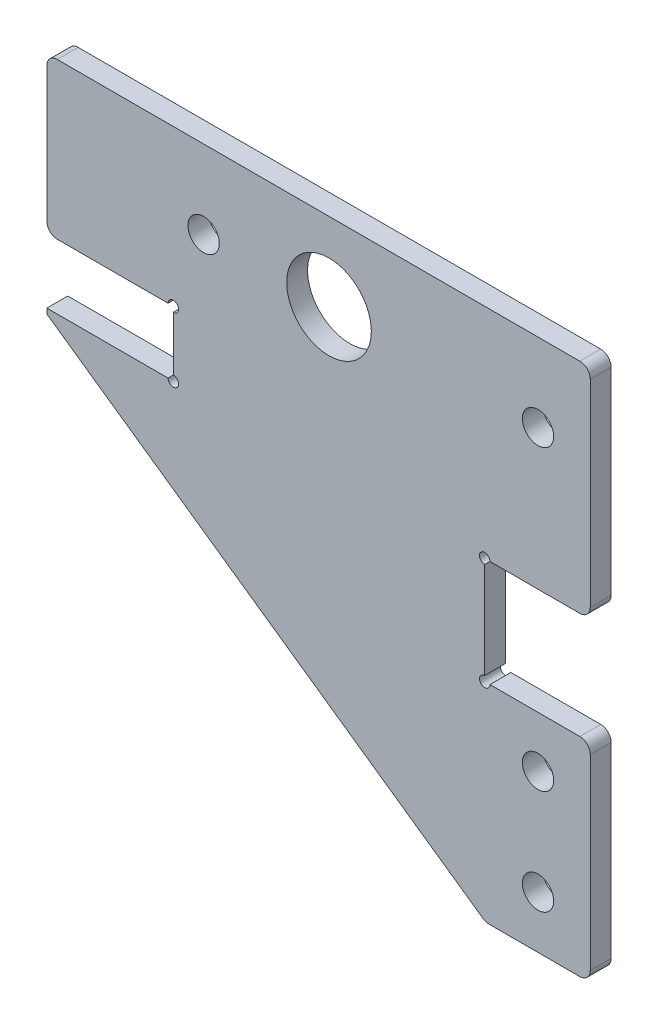
ISO-10303-21;
HEADER;
FILE_DESCRIPTION(('STEP AP214'),'2;1');
FILE_NAME('part.step','',(''),(''),'','','');
FILE_SCHEMA(('AUTOMOTIVE_DESIGN { 1 0 10303 214 1 1 1 1 }'));
ENDSEC;
DATA;
#1=APPLICATION_CONTEXT('core data for automotive mechanical design processes');
#2=APPLICATION_PROTOCOL_DEFINITION('international standard','automotive_design',2000,#1);
#3=PRODUCT_CONTEXT('',#1,'mechanical');
#4=PRODUCT('Part','Part','',(#3));
#5=PRODUCT_RELATED_PRODUCT_CATEGORY('part','',(#4));
#6=PRODUCT_DEFINITION_FORMATION('','',#4);
#7=PRODUCT_DEFINITION_CONTEXT('part definition',#1,'design');
#8=PRODUCT_DEFINITION('design','',#6,#7);
#9=PRODUCT_DEFINITION_SHAPE('','',#8);
#10=(LENGTH_UNIT() NAMED_UNIT(*) SI_UNIT(.MILLI.,.METRE.));
#11=(NAMED_UNIT(*) PLANE_ANGLE_UNIT() SI_UNIT($,.RADIAN.));
#12=(NAMED_UNIT(*) SI_UNIT($,.STERADIAN.) SOLID_ANGLE_UNIT());
#13=UNCERTAINTY_MEASURE_WITH_UNIT(LENGTH_MEASURE(1.E-05),#10,'distance_accuracy_value','');
#14=(GEOMETRIC_REPRESENTATION_CONTEXT(3) GLOBAL_UNCERTAINTY_ASSIGNED_CONTEXT((#13)) GLOBAL_UNIT_ASSIGNED_CONTEXT((#10,
#11,#12)) REPRESENTATION_CONTEXT('',''));
#15=CARTESIAN_POINT('',(0.,0.,0.));
#16=DIRECTION('',(0.,0.,1.));
#17=DIRECTION('',(1.,0.,0.));
#18=AXIS2_PLACEMENT_3D('',#15,#16,#17);
#19=CARTESIAN_POINT('',(0.,0.,2.));
#20=DIRECTION('',(0.,0.,-1.));
#21=DIRECTION('',(-1.,0.,0.));
#22=AXIS2_PLACEMENT_3D('',#19,#20,#21);
#23=PLANE('',#22);
#24=DIRECTION('',(0.819152044288995,-0.573576436351041,0.));
#25=VECTOR('',#24,1.);
#26=CARTESIAN_POINT('',(-4.99999999999999,-43.5,2.));
#27=LINE('',#26,#25);
#28=CARTESIAN_POINT('',(-47.,-14.0912833951925,2.));
#29=VERTEX_POINT('',#28);
#30=CARTESIAN_POINT('',(-5.25827764747206,-43.319152044289,2.));
#31=VERTEX_POINT('',#30);
#32=EDGE_CURVE('E377',#29,#31,#27,.T.);
#33=ORIENTED_EDGE('',*,*,#32,.T.);
#34=CARTESIAN_POINT('',(-4.68470121112102,-42.5,2.));
#35=DIRECTION('',(0.,0.,-1.));
#36=DIRECTION('',(-1.,0.,0.));
#37=AXIS2_PLACEMENT_3D('',#34,#35,#36);
#38=CIRCLE('',#37,1.);
#39=CARTESIAN_POINT('',(-4.68470121112102,-43.5,2.));
#40=VERTEX_POINT('',#39);
#41=EDGE_CURVE('E321',#31,#40,#38,.F.);
#42=ORIENTED_EDGE('',*,*,#41,.T.);
#43=DIRECTION('',(1.,0.,0.));
#44=VECTOR('',#43,1.);
#45=CARTESIAN_POINT('',(-4.99999999999999,-43.5,2.));
#46=LINE('',#45,#44);
#47=CARTESIAN_POINT('',(4.00000000000001,-43.5,2.));
#48=VERTEX_POINT('',#47);
#49=EDGE_CURVE('E379',#40,#48,#46,.T.);
#50=ORIENTED_EDGE('',*,*,#49,.T.);
#51=CARTESIAN_POINT('',(4.00000000000001,-42.5,2.));
#52=DIRECTION('',(0.,0.,-1.));
#53=DIRECTION('',(-1.,0.,0.));
#54=AXIS2_PLACEMENT_3D('',#51,#52,#53);
#55=CIRCLE('',#54,1.);
#56=CARTESIAN_POINT('',(5.00000000000001,-42.5,2.));
#57=VERTEX_POINT('',#56);
#58=EDGE_CURVE('E319',#48,#57,#55,.F.);
#59=ORIENTED_EDGE('',*,*,#58,.T.);
#60=DIRECTION('',(0.,1.,0.));
#61=VECTOR('',#60,1.);
#62=CARTESIAN_POINT('',(5.00000000000001,-43.5,2.));
#63=LINE('',#62,#61);
#64=CARTESIAN_POINT('',(5.00000000000001,-24.6,2.));
#65=VERTEX_POINT('',#64);
#66=EDGE_CURVE('E382',#57,#65,#63,.T.);
#67=ORIENTED_EDGE('',*,*,#66,.T.);
#68=CARTESIAN_POINT('',(4.00000000000001,-24.6,2.));
#69=DIRECTION('',(0.,0.,-1.));
#70=DIRECTION('',(-1.,0.,0.));
#71=AXIS2_PLACEMENT_3D('',#68,#69,#70);
#72=CIRCLE('',#71,1.);
#73=CARTESIAN_POINT('',(4.00000000000001,-23.6,2.));
#74=VERTEX_POINT('',#73);
#75=EDGE_CURVE('E317',#65,#74,#72,.F.);
#76=ORIENTED_EDGE('',*,*,#75,.T.);
#77=DIRECTION('',(-1.,0.,0.));
#78=VECTOR('',#77,1.);
#79=CARTESIAN_POINT('',(5.00000000000001,-23.6,2.));
#80=LINE('',#79,#78);
#81=CARTESIAN_POINT('',(-4.6,-23.6,2.));
#82=VERTEX_POINT('',#81);
#83=EDGE_CURVE('E234',#74,#82,#80,.T.);
#84=ORIENTED_EDGE('',*,*,#83,.T.);
#85=CARTESIAN_POINT('',(-5.1,-23.6,2.));
#86=DIRECTION('',(0.,0.,1.));
#87=DIRECTION('',(1.,0.,0.));
#88=AXIS2_PLACEMENT_3D('',#85,#86,#87);
#89=CIRCLE('',#88,0.500000000000002);
#90=CARTESIAN_POINT('',(-5.1,-23.1,2.));
#91=VERTEX_POINT('',#90);
#92=EDGE_CURVE('E224',#91,#82,#89,.T.);
#93=ORIENTED_EDGE('',*,*,#92,.F.);
#94=DIRECTION('',(0.,1.,0.));
#95=VECTOR('',#94,1.);
#96=CARTESIAN_POINT('',(-5.1,-23.6,2.));
#97=LINE('',#96,#95);
#98=CARTESIAN_POINT('',(-5.1,-13.9,2.));
#99=VERTEX_POINT('',#98);
#100=EDGE_CURVE('E222',#91,#99,#97,.T.);
#101=ORIENTED_EDGE('',*,*,#100,.T.);
#102=CARTESIAN_POINT('',(-5.1,-13.4,2.));
#103=DIRECTION('',(0.,0.,1.));
#104=DIRECTION('',(1.,0.,0.));
#105=AXIS2_PLACEMENT_3D('',#102,#103,#104);
#106=CIRCLE('',#105,0.500000000000002);
#107=CARTESIAN_POINT('',(-4.6,-13.4,2.));
#108=VERTEX_POINT('',#107);
#109=EDGE_CURVE('E203',#108,#99,#106,.T.);
#110=ORIENTED_EDGE('',*,*,#109,.F.);
#111=DIRECTION('',(1.,0.,0.));
#112=VECTOR('',#111,1.);
#113=CARTESIAN_POINT('',(-5.1,-13.4,2.));
#114=LINE('',#113,#112);
#115=CARTESIAN_POINT('',(4.00000000000001,-13.4,2.));
#116=VERTEX_POINT('',#115);
#117=EDGE_CURVE('E218',#108,#116,#114,.T.);
#118=ORIENTED_EDGE('',*,*,#117,.T.);
#119=CARTESIAN_POINT('',(4.00000000000001,-12.4,2.));
#120=DIRECTION('',(0.,0.,-1.));
#121=DIRECTION('',(-1.,0.,0.));
#122=AXIS2_PLACEMENT_3D('',#119,#120,#121);
#123=CIRCLE('',#122,1.);
#124=CARTESIAN_POINT('',(5.00000000000001,-12.4,2.));
#125=VERTEX_POINT('',#124);
#126=EDGE_CURVE('E315',#116,#125,#123,.F.);
#127=ORIENTED_EDGE('',*,*,#126,.T.);
#128=DIRECTION('',(0.,1.,0.));
#129=VECTOR('',#128,1.);
#130=CARTESIAN_POINT('',(5.00000000000001,-13.4,2.));
#131=LINE('',#130,#129);
#132=CARTESIAN_POINT('',(5.00000000000001,6.5,2.));
#133=VERTEX_POINT('',#132);
#134=EDGE_CURVE('E229',#125,#133,#131,.T.);
#135=ORIENTED_EDGE('',*,*,#134,.T.);
#136=CARTESIAN_POINT('',(4.00000000000001,6.5,2.));
#137=DIRECTION('',(0.,0.,-1.));
#138=DIRECTION('',(-1.,0.,0.));
#139=AXIS2_PLACEMENT_3D('',#136,#137,#138);
#140=CIRCLE('',#139,1.);
#141=CARTESIAN_POINT('',(4.00000000000001,7.5,2.));
#142=VERTEX_POINT('',#141);
#143=EDGE_CURVE('E313',#133,#142,#140,.F.);
#144=ORIENTED_EDGE('',*,*,#143,.T.);
#145=DIRECTION('',(-1.,0.,0.));
#146=VECTOR('',#145,1.);
#147=CARTESIAN_POINT('',(5.00000000000001,7.5,2.));
#148=LINE('',#147,#146);
#149=CARTESIAN_POINT('',(-46.,7.49999999999999,2.));
#150=VERTEX_POINT('',#149);
#151=EDGE_CURVE('E232',#142,#150,#148,.T.);
#152=ORIENTED_EDGE('',*,*,#151,.T.);
#153=CARTESIAN_POINT('',(-46.,6.49999999999999,2.));
#154=DIRECTION('',(0.,0.,-1.));
#155=DIRECTION('',(-1.,0.,0.));
#156=AXIS2_PLACEMENT_3D('',#153,#154,#155);
#157=CIRCLE('',#156,1.);
#158=CARTESIAN_POINT('',(-47.,6.5,2.));
#159=VERTEX_POINT('',#158);
#160=EDGE_CURVE('E60',#150,#159,#157,.F.);
#161=ORIENTED_EDGE('',*,*,#160,.T.);
#162=DIRECTION('',(0.,-1.,0.));
#163=VECTOR('',#162,1.);
#164=CARTESIAN_POINT('',(-47.,7.49999999999999,2.));
#165=LINE('',#164,#163);
#166=CARTESIAN_POINT('',(-47.,-6.4,2.));
#167=VERTEX_POINT('',#166);
#168=EDGE_CURVE('E239',#159,#167,#165,.T.);
#169=ORIENTED_EDGE('',*,*,#168,.T.);
#170=CARTESIAN_POINT('',(-46.,-6.4,2.));
#171=DIRECTION('',(0.,0.,-1.));
#172=DIRECTION('',(-1.,0.,0.));
#173=AXIS2_PLACEMENT_3D('',#170,#171,#172);
#174=CIRCLE('',#173,1.);
#175=CARTESIAN_POINT('',(-46.,-7.4,2.));
#176=VERTEX_POINT('',#175);
#177=EDGE_CURVE('E310',#167,#176,#174,.F.);
#178=ORIENTED_EDGE('',*,*,#177,.T.);
#179=DIRECTION('',(1.,0.,0.));
#180=VECTOR('',#179,1.);
#181=CARTESIAN_POINT('',(-47.,-7.4,2.));
#182=LINE('',#181,#180);
#183=CARTESIAN_POINT('',(-35.4,-7.4,2.));
#184=VERTEX_POINT('',#183);
#185=EDGE_CURVE('E276',#176,#184,#182,.T.);
#186=ORIENTED_EDGE('',*,*,#185,.T.);
#187=CARTESIAN_POINT('',(-34.9,-7.4,2.));
#188=DIRECTION('',(0.,0.,1.));
#189=DIRECTION('',(1.,0.,0.));
#190=AXIS2_PLACEMENT_3D('',#187,#188,#189);
#191=CIRCLE('',#190,0.499999999999999);
#192=CARTESIAN_POINT('',(-34.9,-7.9,2.));
#193=VERTEX_POINT('',#192);
#194=EDGE_CURVE('E538',#193,#184,#191,.T.);
#195=ORIENTED_EDGE('',*,*,#194,.F.);
#196=DIRECTION('',(0.,-1.,0.));
#197=VECTOR('',#196,1.);
#198=CARTESIAN_POINT('',(-34.9,-7.4,2.));
#199=LINE('',#198,#197);
#200=CARTESIAN_POINT('',(-34.9,-13.1,2.));
#201=VERTEX_POINT('',#200);
#202=EDGE_CURVE('E365',#193,#201,#199,.T.);
#203=ORIENTED_EDGE('',*,*,#202,.T.);
#204=CARTESIAN_POINT('',(-34.9,-13.6,2.));
#205=DIRECTION('',(0.,0.,1.));
#206=DIRECTION('',(1.,0.,0.));
#207=AXIS2_PLACEMENT_3D('',#204,#205,#206);
#208=CIRCLE('',#207,0.499999999999999);
#209=CARTESIAN_POINT('',(-35.4,-13.6,2.));
#210=VERTEX_POINT('',#209);
#211=EDGE_CURVE('E223',#210,#201,#208,.T.);
#212=ORIENTED_EDGE('',*,*,#211,.F.);
#213=DIRECTION('',(-1.,0.,0.));
#214=VECTOR('',#213,1.);
#215=CARTESIAN_POINT('',(-34.9,-13.6,2.));
#216=LINE('',#215,#214);
#217=CARTESIAN_POINT('',(-47.,-13.6,2.));
#218=VERTEX_POINT('',#217);
#219=EDGE_CURVE('E368',#210,#218,#216,.T.);
#220=ORIENTED_EDGE('',*,*,#219,.T.);
#221=DIRECTION('',(0.,-1.,0.));
#222=VECTOR('',#221,1.);
#223=CARTESIAN_POINT('',(-47.,-13.6,2.));
#224=LINE('',#223,#222);
#225=EDGE_CURVE('E375',#218,#29,#224,.T.);
#226=ORIENTED_EDGE('',*,*,#225,.T.);
#227=EDGE_LOOP('',(#33,#42,#50,#59,#67,#76,#84,#93,#101,#110,#118,#127,#135,#144,#152,#161,#169,
#178,#186,#195,#203,#212,#220,#226));
#228=FACE_BOUND('',#227,.T.);
#229=CARTESIAN_POINT('',(-32.,0.,2.));
#230=DIRECTION('',(0.,0.,1.));
#231=DIRECTION('',(1.,0.,0.));
#232=AXIS2_PLACEMENT_3D('',#229,#230,#231);
#233=CIRCLE('',#232,1.50000000000003);
#234=CARTESIAN_POINT('',(-30.5,0.,2.));
#235=VERTEX_POINT('',#234);
#236=EDGE_CURVE('E245',#235,#235,#233,.T.);
#237=ORIENTED_EDGE('',*,*,#236,.F.);
#238=EDGE_LOOP('',(#237));
#239=FACE_BOUND('',#238,.T.);
#240=CARTESIAN_POINT('',(0.,0.,2.));
#241=DIRECTION('',(0.,0.,1.));
#242=DIRECTION('',(1.,0.,0.));
#243=AXIS2_PLACEMENT_3D('',#240,#241,#242);
#244=CIRCLE('',#243,1.5);
#245=CARTESIAN_POINT('',(1.5,0.,2.));
#246=VERTEX_POINT('',#245);
#247=EDGE_CURVE('E431',#246,#246,#244,.T.);
#248=ORIENTED_EDGE('',*,*,#247,.F.);
#249=EDGE_LOOP('',(#248));
#250=FACE_BOUND('',#249,.T.);
#251=CARTESIAN_POINT('',(0.,-38.5,2.));
#252=DIRECTION('',(0.,0.,1.));
#253=DIRECTION('',(1.,0.,0.));
#254=AXIS2_PLACEMENT_3D('',#251,#252,#253);
#255=CIRCLE('',#254,1.5);
#256=CARTESIAN_POINT('',(1.50000000000001,-38.5,2.));
#257=VERTEX_POINT('',#256);
#258=EDGE_CURVE('E425',#257,#257,#255,.T.);
#259=ORIENTED_EDGE('',*,*,#258,.F.);
#260=EDGE_LOOP('',(#259));
#261=FACE_BOUND('',#260,.T.);
#262=CARTESIAN_POINT('',(0.,-28.5,2.));
#263=DIRECTION('',(0.,0.,1.));
#264=DIRECTION('',(1.,0.,0.));
#265=AXIS2_PLACEMENT_3D('',#262,#263,#264);
#266=CIRCLE('',#265,1.5);
#267=CARTESIAN_POINT('',(1.5,-28.5,2.));
#268=VERTEX_POINT('',#267);
#269=EDGE_CURVE('E419',#268,#268,#266,.T.);
#270=ORIENTED_EDGE('',*,*,#269,.F.);
#271=EDGE_LOOP('',(#270));
#272=FACE_BOUND('',#271,.T.);
#273=CARTESIAN_POINT('',(-20.,0.,2.));
#274=DIRECTION('',(0.,0.,1.));
#275=DIRECTION('',(1.,0.,0.));
#276=AXIS2_PLACEMENT_3D('',#273,#274,#275);
#277=CIRCLE('',#276,4.05);
#278=CARTESIAN_POINT('',(-15.95,0.,2.));
#279=VERTEX_POINT('',#278);
#280=EDGE_CURVE('E413',#279,#279,#277,.T.);
#281=ORIENTED_EDGE('',*,*,#280,.F.);
#282=EDGE_LOOP('',(#281));
#283=FACE_BOUND('',#282,.T.);
#284=ADVANCED_FACE('F38',(#228,#239,#250,#261,#272,#283),#23,.F.);
#285=CARTESIAN_POINT('',(0.,0.,0.));
#286=DIRECTION('',(0.,0.,-1.));
#287=DIRECTION('',(-1.,0.,0.));
#288=AXIS2_PLACEMENT_3D('',#285,#286,#287);
#289=PLANE('',#288);
#290=DIRECTION('',(1.,0.,0.));
#291=VECTOR('',#290,1.);
#292=CARTESIAN_POINT('',(-4.99999999999999,-43.5,0.));
#293=LINE('',#292,#291);
#294=CARTESIAN_POINT('',(-4.68470121112102,-43.5,0.));
#295=VERTEX_POINT('',#294);
#296=CARTESIAN_POINT('',(4.00000000000001,-43.5,0.));
#297=VERTEX_POINT('',#296);
#298=EDGE_CURVE('E255',#295,#297,#293,.T.);
#299=ORIENTED_EDGE('',*,*,#298,.F.);
#300=CARTESIAN_POINT('',(-4.68470121112102,-42.5,0.));
#301=DIRECTION('',(0.,0.,-1.));
#302=DIRECTION('',(-1.,0.,0.));
#303=AXIS2_PLACEMENT_3D('',#300,#301,#302);
#304=CIRCLE('',#303,1.);
#305=CARTESIAN_POINT('',(-5.25827764747206,-43.319152044289,0.));
#306=VERTEX_POINT('',#305);
#307=EDGE_CURVE('E306',#295,#306,#304,.T.);
#308=ORIENTED_EDGE('',*,*,#307,.T.);
#309=DIRECTION('',(0.819152044288995,-0.573576436351041,0.));
#310=VECTOR('',#309,1.);
#311=CARTESIAN_POINT('',(-4.99999999999999,-43.5,0.));
#312=LINE('',#311,#310);
#313=CARTESIAN_POINT('',(-47.,-14.0912833951925,0.));
#314=VERTEX_POINT('',#313);
#315=EDGE_CURVE('E252',#314,#306,#312,.T.);
#316=ORIENTED_EDGE('',*,*,#315,.F.);
#317=DIRECTION('',(0.,-1.,0.));
#318=VECTOR('',#317,1.);
#319=CARTESIAN_POINT('',(-47.,-13.6,0.));
#320=LINE('',#319,#318);
#321=CARTESIAN_POINT('',(-47.,-13.6,0.));
#322=VERTEX_POINT('',#321);
#323=EDGE_CURVE('E250',#322,#314,#320,.T.);
#324=ORIENTED_EDGE('',*,*,#323,.F.);
#325=DIRECTION('',(-1.,0.,0.));
#326=VECTOR('',#325,1.);
#327=CARTESIAN_POINT('',(-34.9,-13.6,0.));
#328=LINE('',#327,#326);
#329=CARTESIAN_POINT('',(-35.4,-13.6,0.));
#330=VERTEX_POINT('',#329);
#331=EDGE_CURVE('E248',#330,#322,#328,.T.);
#332=ORIENTED_EDGE('',*,*,#331,.F.);
#333=CARTESIAN_POINT('',(-34.9,-13.6,0.));
#334=DIRECTION('',(0.,0.,-1.));
#335=DIRECTION('',(-1.,0.,0.));
#336=AXIS2_PLACEMENT_3D('',#333,#334,#335);
#337=CIRCLE('',#336,0.499999999999999);
#338=CARTESIAN_POINT('',(-34.9,-13.1,0.));
#339=VERTEX_POINT('',#338);
#340=EDGE_CURVE('E398',#339,#330,#337,.T.);
#341=ORIENTED_EDGE('',*,*,#340,.F.);
#342=DIRECTION('',(0.,-1.,0.));
#343=VECTOR('',#342,1.);
#344=CARTESIAN_POINT('',(-34.9,-7.4,0.));
#345=LINE('',#344,#343);
#346=CARTESIAN_POINT('',(-34.9,-7.9,0.));
#347=VERTEX_POINT('',#346);
#348=EDGE_CURVE('E244',#347,#339,#345,.T.);
#349=ORIENTED_EDGE('',*,*,#348,.F.);
#350=CARTESIAN_POINT('',(-34.9,-7.4,0.));
#351=DIRECTION('',(0.,0.,-1.));
#352=DIRECTION('',(-1.,0.,0.));
#353=AXIS2_PLACEMENT_3D('',#350,#351,#352);
#354=CIRCLE('',#353,0.499999999999999);
#355=CARTESIAN_POINT('',(-35.4,-7.4,0.));
#356=VERTEX_POINT('',#355);
#357=EDGE_CURVE('E409',#356,#347,#354,.T.);
#358=ORIENTED_EDGE('',*,*,#357,.F.);
#359=DIRECTION('',(1.,0.,0.));
#360=VECTOR('',#359,1.);
#361=CARTESIAN_POINT('',(-47.,-7.4,0.));
#362=LINE('',#361,#360);
#363=CARTESIAN_POINT('',(-46.,-7.4,0.));
#364=VERTEX_POINT('',#363);
#365=EDGE_CURVE('E242',#364,#356,#362,.T.);
#366=ORIENTED_EDGE('',*,*,#365,.F.);
#367=CARTESIAN_POINT('',(-46.,-6.4,0.));
#368=DIRECTION('',(0.,0.,-1.));
#369=DIRECTION('',(-1.,0.,0.));
#370=AXIS2_PLACEMENT_3D('',#367,#368,#369);
#371=CIRCLE('',#370,1.);
#372=CARTESIAN_POINT('',(-47.,-6.4,0.));
#373=VERTEX_POINT('',#372);
#374=EDGE_CURVE('E294',#364,#373,#371,.T.);
#375=ORIENTED_EDGE('',*,*,#374,.T.);
#376=DIRECTION('',(0.,-1.,0.));
#377=VECTOR('',#376,1.);
#378=CARTESIAN_POINT('',(-47.,7.49999999999999,0.));
#379=LINE('',#378,#377);
#380=CARTESIAN_POINT('',(-47.,6.5,0.));
#381=VERTEX_POINT('',#380);
#382=EDGE_CURVE('E274',#381,#373,#379,.T.);
#383=ORIENTED_EDGE('',*,*,#382,.F.);
#384=CARTESIAN_POINT('',(-46.,6.49999999999999,0.));
#385=DIRECTION('',(0.,0.,-1.));
#386=DIRECTION('',(-1.,0.,0.));
#387=AXIS2_PLACEMENT_3D('',#384,#385,#386);
#388=CIRCLE('',#387,1.);
#389=CARTESIAN_POINT('',(-46.,7.49999999999999,0.));
#390=VERTEX_POINT('',#389);
#391=EDGE_CURVE('E296',#381,#390,#388,.T.);
#392=ORIENTED_EDGE('',*,*,#391,.T.);
#393=DIRECTION('',(-1.,0.,0.));
#394=VECTOR('',#393,1.);
#395=CARTESIAN_POINT('',(5.00000000000001,7.5,0.));
#396=LINE('',#395,#394);
#397=CARTESIAN_POINT('',(4.00000000000001,7.5,0.));
#398=VERTEX_POINT('',#397);
#399=EDGE_CURVE('E271',#398,#390,#396,.T.);
#400=ORIENTED_EDGE('',*,*,#399,.F.);
#401=CARTESIAN_POINT('',(4.00000000000001,6.5,0.));
#402=DIRECTION('',(0.,0.,-1.));
#403=DIRECTION('',(-1.,0.,0.));
#404=AXIS2_PLACEMENT_3D('',#401,#402,#403);
#405=CIRCLE('',#404,1.);
#406=CARTESIAN_POINT('',(5.00000000000001,6.5,0.));
#407=VERTEX_POINT('',#406);
#408=EDGE_CURVE('E298',#398,#407,#405,.T.);
#409=ORIENTED_EDGE('',*,*,#408,.T.);
#410=DIRECTION('',(0.,1.,0.));
#411=VECTOR('',#410,1.);
#412=CARTESIAN_POINT('',(5.00000000000001,-13.4,0.));
#413=LINE('',#412,#411);
#414=CARTESIAN_POINT('',(5.00000000000001,-12.4,0.));
#415=VERTEX_POINT('',#414);
#416=EDGE_CURVE('E268',#415,#407,#413,.T.);
#417=ORIENTED_EDGE('',*,*,#416,.F.);
#418=CARTESIAN_POINT('',(4.00000000000001,-12.4,0.));
#419=DIRECTION('',(0.,0.,-1.));
#420=DIRECTION('',(-1.,0.,0.));
#421=AXIS2_PLACEMENT_3D('',#418,#419,#420);
#422=CIRCLE('',#421,1.);
#423=CARTESIAN_POINT('',(4.00000000000001,-13.4,0.));
#424=VERTEX_POINT('',#423);
#425=EDGE_CURVE('E300',#415,#424,#422,.T.);
#426=ORIENTED_EDGE('',*,*,#425,.T.);
#427=DIRECTION('',(1.,0.,0.));
#428=VECTOR('',#427,1.);
#429=CARTESIAN_POINT('',(-5.1,-13.4,0.));
#430=LINE('',#429,#428);
#431=CARTESIAN_POINT('',(-4.6,-13.4,0.));
#432=VERTEX_POINT('',#431);
#433=EDGE_CURVE('E266',#432,#424,#430,.T.);
#434=ORIENTED_EDGE('',*,*,#433,.F.);
#435=CARTESIAN_POINT('',(-5.1,-13.4,0.));
#436=DIRECTION('',(0.,0.,-1.));
#437=DIRECTION('',(-1.,0.,0.));
#438=AXIS2_PLACEMENT_3D('',#435,#436,#437);
#439=CIRCLE('',#438,0.500000000000002);
#440=CARTESIAN_POINT('',(-5.1,-13.9,0.));
#441=VERTEX_POINT('',#440);
#442=EDGE_CURVE('E206',#441,#432,#439,.T.);
#443=ORIENTED_EDGE('',*,*,#442,.F.);
#444=DIRECTION('',(0.,1.,0.));
#445=VECTOR('',#444,1.);
#446=CARTESIAN_POINT('',(-5.1,-23.6,0.));
#447=LINE('',#446,#445);
#448=CARTESIAN_POINT('',(-5.1,-23.1,0.));
#449=VERTEX_POINT('',#448);
#450=EDGE_CURVE('E263',#449,#441,#447,.T.);
#451=ORIENTED_EDGE('',*,*,#450,.F.);
#452=CARTESIAN_POINT('',(-5.1,-23.6,0.));
#453=DIRECTION('',(0.,0.,-1.));
#454=DIRECTION('',(-1.,0.,0.));
#455=AXIS2_PLACEMENT_3D('',#452,#453,#454);
#456=CIRCLE('',#455,0.500000000000002);
#457=CARTESIAN_POINT('',(-4.6,-23.6,0.));
#458=VERTEX_POINT('',#457);
#459=EDGE_CURVE('E399',#458,#449,#456,.T.);
#460=ORIENTED_EDGE('',*,*,#459,.F.);
#461=DIRECTION('',(-1.,0.,0.));
#462=VECTOR('',#461,1.);
#463=CARTESIAN_POINT('',(5.00000000000001,-23.6,0.));
#464=LINE('',#463,#462);
#465=CARTESIAN_POINT('',(4.00000000000001,-23.6,0.));
#466=VERTEX_POINT('',#465);
#467=EDGE_CURVE('E261',#466,#458,#464,.T.);
#468=ORIENTED_EDGE('',*,*,#467,.F.);
#469=CARTESIAN_POINT('',(4.00000000000001,-24.6,0.));
#470=DIRECTION('',(0.,0.,-1.));
#471=DIRECTION('',(-1.,0.,0.));
#472=AXIS2_PLACEMENT_3D('',#469,#470,#471);
#473=CIRCLE('',#472,1.);
#474=CARTESIAN_POINT('',(5.00000000000001,-24.6,0.));
#475=VERTEX_POINT('',#474);
#476=EDGE_CURVE('E302',#466,#475,#473,.T.);
#477=ORIENTED_EDGE('',*,*,#476,.T.);
#478=DIRECTION('',(0.,1.,0.));
#479=VECTOR('',#478,1.);
#480=CARTESIAN_POINT('',(5.00000000000001,-43.5,0.));
#481=LINE('',#480,#479);
#482=CARTESIAN_POINT('',(5.00000000000001,-42.5,0.));
#483=VERTEX_POINT('',#482);
#484=EDGE_CURVE('E258',#483,#475,#481,.T.);
#485=ORIENTED_EDGE('',*,*,#484,.F.);
#486=CARTESIAN_POINT('',(4.00000000000001,-42.5,0.));
#487=DIRECTION('',(0.,0.,-1.));
#488=DIRECTION('',(-1.,0.,0.));
#489=AXIS2_PLACEMENT_3D('',#486,#487,#488);
#490=CIRCLE('',#489,1.);
#491=EDGE_CURVE('E304',#483,#297,#490,.T.);
#492=ORIENTED_EDGE('',*,*,#491,.T.);
#493=EDGE_LOOP('',(#299,#308,#316,#324,#332,#341,#349,#358,#366,#375,#383,#392,#400,#409,#417,
#426,#434,#443,#451,#460,#468,#477,#485,#492));
#494=FACE_BOUND('',#493,.T.);
#495=CARTESIAN_POINT('',(0.,-28.5,0.));
#496=DIRECTION('',(0.,0.,1.));
#497=DIRECTION('',(1.,0.,0.));
#498=AXIS2_PLACEMENT_3D('',#495,#496,#497);
#499=CIRCLE('',#498,1.5);
#500=CARTESIAN_POINT('',(1.5,-28.5,0.));
#501=VERTEX_POINT('',#500);
#502=EDGE_CURVE('E416',#501,#501,#499,.T.);
#503=ORIENTED_EDGE('',*,*,#502,.T.);
#504=EDGE_LOOP('',(#503));
#505=FACE_BOUND('',#504,.T.);
#506=CARTESIAN_POINT('',(0.,0.,0.));
#507=DIRECTION('',(0.,0.,1.));
#508=DIRECTION('',(1.,0.,0.));
#509=AXIS2_PLACEMENT_3D('',#506,#507,#508);
#510=CIRCLE('',#509,1.5);
#511=CARTESIAN_POINT('',(1.5,0.,0.));
#512=VERTEX_POINT('',#511);
#513=EDGE_CURVE('E428',#512,#512,#510,.T.);
#514=ORIENTED_EDGE('',*,*,#513,.T.);
#515=EDGE_LOOP('',(#514));
#516=FACE_BOUND('',#515,.T.);
#517=CARTESIAN_POINT('',(-32.,0.,0.));
#518=DIRECTION('',(0.,0.,1.));
#519=DIRECTION('',(1.,0.,0.));
#520=AXIS2_PLACEMENT_3D('',#517,#518,#519);
#521=CIRCLE('',#520,1.50000000000003);
#522=CARTESIAN_POINT('',(-30.5,0.,0.));
#523=VERTEX_POINT('',#522);
#524=EDGE_CURVE('E371',#523,#523,#521,.T.);
#525=ORIENTED_EDGE('',*,*,#524,.T.);
#526=EDGE_LOOP('',(#525));
#527=FACE_BOUND('',#526,.T.);
#528=CARTESIAN_POINT('',(0.,-38.5,0.));
#529=DIRECTION('',(0.,0.,1.));
#530=DIRECTION('',(1.,0.,0.));
#531=AXIS2_PLACEMENT_3D('',#528,#529,#530);
#532=CIRCLE('',#531,1.5);
#533=CARTESIAN_POINT('',(1.50000000000001,-38.5,0.));
#534=VERTEX_POINT('',#533);
#535=EDGE_CURVE('E422',#534,#534,#532,.T.);
#536=ORIENTED_EDGE('',*,*,#535,.T.);
#537=EDGE_LOOP('',(#536));
#538=FACE_BOUND('',#537,.T.);
#539=CARTESIAN_POINT('',(-20.,0.,0.));
#540=DIRECTION('',(0.,0.,1.));
#541=DIRECTION('',(1.,0.,0.));
#542=AXIS2_PLACEMENT_3D('',#539,#540,#541);
#543=CIRCLE('',#542,4.05);
#544=CARTESIAN_POINT('',(-15.95,0.,0.));
#545=VERTEX_POINT('',#544);
#546=EDGE_CURVE('E412',#545,#545,#543,.T.);
#547=ORIENTED_EDGE('',*,*,#546,.T.);
#548=EDGE_LOOP('',(#547));
#549=FACE_BOUND('',#548,.T.);
#550=ADVANCED_FACE('F349',(#494,#505,#516,#527,#538,#549),#289,.T.);
#551=CARTESIAN_POINT('',(-47.,-7.4,2.));
#552=DIRECTION('',(0.,1.,0.));
#553=DIRECTION('',(-1.,0.,0.));
#554=AXIS2_PLACEMENT_3D('',#551,#552,#553);
#555=PLANE('',#554);
#556=ORIENTED_EDGE('',*,*,#185,.F.);
#557=DIRECTION('',(0.,0.,-1.));
#558=VECTOR('',#557,1.);
#559=CARTESIAN_POINT('',(-46.,-7.4,2.));
#560=LINE('',#559,#558);
#561=EDGE_CURVE('E11',#176,#364,#560,.T.);
#562=ORIENTED_EDGE('',*,*,#561,.T.);
#563=ORIENTED_EDGE('',*,*,#365,.T.);
#564=DIRECTION('',(0.,0.,1.));
#565=VECTOR('',#564,1.);
#566=CARTESIAN_POINT('',(-35.4,-7.4,-8.));
#567=LINE('',#566,#565);
#568=EDGE_CURVE('E362',#356,#184,#567,.T.);
#569=ORIENTED_EDGE('',*,*,#568,.T.);
#570=EDGE_LOOP('',(#556,#562,#563,#569));
#571=FACE_BOUND('',#570,.T.);
#572=ADVANCED_FACE('F359',(#571),#555,.F.);
#573=CARTESIAN_POINT('',(-34.9,-7.4,2.));
#574=DIRECTION('',(1.,0.,0.));
#575=DIRECTION('',(0.,0.,-1.));
#576=AXIS2_PLACEMENT_3D('',#573,#574,#575);
#577=PLANE('',#576);
#578=ORIENTED_EDGE('',*,*,#202,.F.);
#579=DIRECTION('',(0.,0.,1.));
#580=VECTOR('',#579,1.);
#581=CARTESIAN_POINT('',(-34.9,-7.9,-8.));
#582=LINE('',#581,#580);
#583=EDGE_CURVE('E286',#193,#347,#582,.F.);
#584=ORIENTED_EDGE('',*,*,#583,.T.);
#585=ORIENTED_EDGE('',*,*,#348,.T.);
#586=DIRECTION('',(0.,0.,1.));
#587=VECTOR('',#586,1.);
#588=CARTESIAN_POINT('',(-34.9,-13.1,-8.));
#589=LINE('',#588,#587);
#590=EDGE_CURVE('E401',#339,#201,#589,.T.);
#591=ORIENTED_EDGE('',*,*,#590,.T.);
#592=EDGE_LOOP('',(#578,#584,#585,#591));
#593=FACE_BOUND('',#592,.T.);
#594=ADVANCED_FACE('F497',(#593),#577,.F.);
#595=CARTESIAN_POINT('',(-34.9,-13.6,2.));
#596=DIRECTION('',(0.,-1.,0.));
#597=DIRECTION('',(1.,0.,0.));
#598=AXIS2_PLACEMENT_3D('',#595,#596,#597);
#599=PLANE('',#598);
#600=ORIENTED_EDGE('',*,*,#219,.F.);
#601=DIRECTION('',(0.,0.,1.));
#602=VECTOR('',#601,1.);
#603=CARTESIAN_POINT('',(-35.4,-13.6,-8.));
#604=LINE('',#603,#602);
#605=EDGE_CURVE('E283',#210,#330,#604,.F.);
#606=ORIENTED_EDGE('',*,*,#605,.T.);
#607=ORIENTED_EDGE('',*,*,#331,.T.);
#608=DIRECTION('',(0.,0.,-1.));
#609=VECTOR('',#608,1.);
#610=CARTESIAN_POINT('',(-47.,-13.6,2.));
#611=LINE('',#610,#609);
#612=EDGE_CURVE('E212',#218,#322,#611,.T.);
#613=ORIENTED_EDGE('',*,*,#612,.F.);
#614=EDGE_LOOP('',(#600,#606,#607,#613));
#615=FACE_BOUND('',#614,.T.);
#616=ADVANCED_FACE('F493',(#615),#599,.F.);
#617=CARTESIAN_POINT('',(-47.,-13.6,2.));
#618=DIRECTION('',(1.,0.,0.));
#619=DIRECTION('',(0.,0.,-1.));
#620=AXIS2_PLACEMENT_3D('',#617,#618,#619);
#621=PLANE('',#620);
#622=ORIENTED_EDGE('',*,*,#323,.T.);
#623=DIRECTION('',(0.,0.,-1.));
#624=VECTOR('',#623,1.);
#625=CARTESIAN_POINT('',(-47.,-14.0912833951925,2.));
#626=LINE('',#625,#624);
#627=EDGE_CURVE('E241',#29,#314,#626,.T.);
#628=ORIENTED_EDGE('',*,*,#627,.F.);
#629=ORIENTED_EDGE('',*,*,#225,.F.);
#630=ORIENTED_EDGE('',*,*,#612,.T.);
#631=EDGE_LOOP('',(#622,#628,#629,#630));
#632=FACE_BOUND('',#631,.T.);
#633=ADVANCED_FACE('F489',(#632),#621,.F.);
#634=CARTESIAN_POINT('',(-4.99999999999999,-43.5,2.));
#635=DIRECTION('',(0.573576436351041,0.819152044288995,0.));
#636=DIRECTION('',(-0.819152044288995,0.573576436351041,0.));
#637=AXIS2_PLACEMENT_3D('',#634,#635,#636);
#638=PLANE('',#637);
#639=ORIENTED_EDGE('',*,*,#315,.T.);
#640=DIRECTION('',(0.,0.,-1.));
#641=VECTOR('',#640,1.);
#642=CARTESIAN_POINT('',(-5.25827764747206,-43.319152044289,2.));
#643=LINE('',#642,#641);
#644=EDGE_CURVE('E308',#306,#31,#643,.F.);
#645=ORIENTED_EDGE('',*,*,#644,.T.);
#646=ORIENTED_EDGE('',*,*,#32,.F.);
#647=ORIENTED_EDGE('',*,*,#627,.T.);
#648=EDGE_LOOP('',(#639,#645,#646,#647));
#649=FACE_BOUND('',#648,.T.);
#650=ADVANCED_FACE('F485',(#649),#638,.F.);
#651=CARTESIAN_POINT('',(-4.99999999999999,-43.5,2.));
#652=DIRECTION('',(0.,1.,0.));
#653=DIRECTION('',(0.,0.,1.));
#654=AXIS2_PLACEMENT_3D('',#651,#652,#653);
#655=PLANE('',#654);
#656=ORIENTED_EDGE('',*,*,#49,.F.);
#657=DIRECTION('',(0.,0.,-1.));
#658=VECTOR('',#657,1.);
#659=CARTESIAN_POINT('',(-4.68470121112102,-43.5,2.));
#660=LINE('',#659,#658);
#661=EDGE_CURVE('E291',#40,#295,#660,.T.);
#662=ORIENTED_EDGE('',*,*,#661,.T.);
#663=ORIENTED_EDGE('',*,*,#298,.T.);
#664=DIRECTION('',(0.,0.,-1.));
#665=VECTOR('',#664,1.);
#666=CARTESIAN_POINT('',(4.00000000000001,-43.5,2.));
#667=LINE('',#666,#665);
#668=EDGE_CURVE('E289',#297,#48,#667,.F.);
#669=ORIENTED_EDGE('',*,*,#668,.T.);
#670=EDGE_LOOP('',(#656,#662,#663,#669));
#671=FACE_BOUND('',#670,.T.);
#672=ADVANCED_FACE('F481',(#671),#655,.F.);
#673=CARTESIAN_POINT('',(5.00000000000001,-43.5,2.));
#674=DIRECTION('',(-1.,0.,0.));
#675=DIRECTION('',(0.,-1.,0.));
#676=AXIS2_PLACEMENT_3D('',#673,#674,#675);
#677=PLANE('',#676);
#678=ORIENTED_EDGE('',*,*,#66,.F.);
#679=DIRECTION('',(0.,0.,-1.));
#680=VECTOR('',#679,1.);
#681=CARTESIAN_POINT('',(5.00000000000001,-42.5,2.));
#682=LINE('',#681,#680);
#683=EDGE_CURVE('E325',#57,#483,#682,.T.);
#684=ORIENTED_EDGE('',*,*,#683,.T.);
#685=ORIENTED_EDGE('',*,*,#484,.T.);
#686=DIRECTION('',(0.,0.,-1.));
#687=VECTOR('',#686,1.);
#688=CARTESIAN_POINT('',(5.00000000000001,-24.6,2.));
#689=LINE('',#688,#687);
#690=EDGE_CURVE('E323',#475,#65,#689,.F.);
#691=ORIENTED_EDGE('',*,*,#690,.T.);
#692=EDGE_LOOP('',(#678,#684,#685,#691));
#693=FACE_BOUND('',#692,.T.);
#694=ADVANCED_FACE('F478',(#693),#677,.F.);
#695=CARTESIAN_POINT('',(5.00000000000001,-23.6,2.));
#696=DIRECTION('',(0.,-1.,0.));
#697=DIRECTION('',(1.,0.,0.));
#698=AXIS2_PLACEMENT_3D('',#695,#696,#697);
#699=PLANE('',#698);
#700=ORIENTED_EDGE('',*,*,#83,.F.);
#701=DIRECTION('',(0.,0.,-1.));
#702=VECTOR('',#701,1.);
#703=CARTESIAN_POINT('',(4.00000000000001,-23.6,2.));
#704=LINE('',#703,#702);
#705=EDGE_CURVE('E328',#74,#466,#704,.T.);
#706=ORIENTED_EDGE('',*,*,#705,.T.);
#707=ORIENTED_EDGE('',*,*,#467,.T.);
#708=DIRECTION('',(0.,0.,1.));
#709=VECTOR('',#708,1.);
#710=CARTESIAN_POINT('',(-4.6,-23.6,-8.));
#711=LINE('',#710,#709);
#712=EDGE_CURVE('E393',#458,#82,#711,.T.);
#713=ORIENTED_EDGE('',*,*,#712,.T.);
#714=EDGE_LOOP('',(#700,#706,#707,#713));
#715=FACE_BOUND('',#714,.T.);
#716=ADVANCED_FACE('F396',(#715),#699,.F.);
#717=CARTESIAN_POINT('',(-5.1,-23.6,2.));
#718=DIRECTION('',(-1.,0.,0.));
#719=DIRECTION('',(0.,0.,1.));
#720=AXIS2_PLACEMENT_3D('',#717,#718,#719);
#721=PLANE('',#720);
#722=ORIENTED_EDGE('',*,*,#450,.T.);
#723=DIRECTION('',(0.,0.,1.));
#724=VECTOR('',#723,1.);
#725=CARTESIAN_POINT('',(-5.1,-13.9,-8.));
#726=LINE('',#725,#724);
#727=EDGE_CURVE('E403',#441,#99,#726,.T.);
#728=ORIENTED_EDGE('',*,*,#727,.T.);
#729=ORIENTED_EDGE('',*,*,#100,.F.);
#730=DIRECTION('',(0.,0.,1.));
#731=VECTOR('',#730,1.);
#732=CARTESIAN_POINT('',(-5.1,-23.1,-8.));
#733=LINE('',#732,#731);
#734=EDGE_CURVE('E211',#91,#449,#733,.F.);
#735=ORIENTED_EDGE('',*,*,#734,.T.);
#736=EDGE_LOOP('',(#722,#728,#729,#735));
#737=FACE_BOUND('',#736,.T.);
#738=ADVANCED_FACE('F472',(#737),#721,.F.);
#739=CARTESIAN_POINT('',(-5.1,-13.4,2.));
#740=DIRECTION('',(0.,1.,0.));
#741=DIRECTION('',(-1.,0.,0.));
#742=AXIS2_PLACEMENT_3D('',#739,#740,#741);
#743=PLANE('',#742);
#744=ORIENTED_EDGE('',*,*,#433,.T.);
#745=DIRECTION('',(0.,0.,-1.));
#746=VECTOR('',#745,1.);
#747=CARTESIAN_POINT('',(4.00000000000001,-13.4,2.));
#748=LINE('',#747,#746);
#749=EDGE_CURVE('E228',#424,#116,#748,.F.);
#750=ORIENTED_EDGE('',*,*,#749,.T.);
#751=ORIENTED_EDGE('',*,*,#117,.F.);
#752=DIRECTION('',(0.,0.,1.));
#753=VECTOR('',#752,1.);
#754=CARTESIAN_POINT('',(-4.6,-13.4,-8.));
#755=LINE('',#754,#753);
#756=EDGE_CURVE('E200',#108,#432,#755,.F.);
#757=ORIENTED_EDGE('',*,*,#756,.T.);
#758=EDGE_LOOP('',(#744,#750,#751,#757));
#759=FACE_BOUND('',#758,.T.);
#760=ADVANCED_FACE('F226',(#759),#743,.F.);
#761=CARTESIAN_POINT('',(5.00000000000001,-13.4,2.));
#762=DIRECTION('',(-1.,0.,0.));
#763=DIRECTION('',(0.,-1.,0.));
#764=AXIS2_PLACEMENT_3D('',#761,#762,#763);
#765=PLANE('',#764);
#766=ORIENTED_EDGE('',*,*,#134,.F.);
#767=DIRECTION('',(0.,0.,-1.));
#768=VECTOR('',#767,1.);
#769=CARTESIAN_POINT('',(5.00000000000001,-12.4,2.));
#770=LINE('',#769,#768);
#771=EDGE_CURVE('E333',#125,#415,#770,.T.);
#772=ORIENTED_EDGE('',*,*,#771,.T.);
#773=ORIENTED_EDGE('',*,*,#416,.T.);
#774=DIRECTION('',(0.,0.,-1.));
#775=VECTOR('',#774,1.);
#776=CARTESIAN_POINT('',(5.00000000000001,6.5,2.));
#777=LINE('',#776,#775);
#778=EDGE_CURVE('E331',#407,#133,#777,.F.);
#779=ORIENTED_EDGE('',*,*,#778,.T.);
#780=EDGE_LOOP('',(#766,#772,#773,#779));
#781=FACE_BOUND('',#780,.T.);
#782=ADVANCED_FACE('F465',(#781),#765,.F.);
#783=CARTESIAN_POINT('',(5.00000000000001,7.5,2.));
#784=DIRECTION('',(0.,-1.,0.));
#785=DIRECTION('',(1.,0.,0.));
#786=AXIS2_PLACEMENT_3D('',#783,#784,#785);
#787=PLANE('',#786);
#788=ORIENTED_EDGE('',*,*,#151,.F.);
#789=DIRECTION('',(0.,0.,-1.));
#790=VECTOR('',#789,1.);
#791=CARTESIAN_POINT('',(4.00000000000001,7.5,2.));
#792=LINE('',#791,#790);
#793=EDGE_CURVE('E339',#142,#398,#792,.T.);
#794=ORIENTED_EDGE('',*,*,#793,.T.);
#795=ORIENTED_EDGE('',*,*,#399,.T.);
#796=DIRECTION('',(0.,0.,-1.));
#797=VECTOR('',#796,1.);
#798=CARTESIAN_POINT('',(-46.,7.49999999999999,2.));
#799=LINE('',#798,#797);
#800=EDGE_CURVE('E337',#390,#150,#799,.F.);
#801=ORIENTED_EDGE('',*,*,#800,.T.);
#802=EDGE_LOOP('',(#788,#794,#795,#801));
#803=FACE_BOUND('',#802,.T.);
#804=ADVANCED_FACE('F454',(#803),#787,.F.);
#805=CARTESIAN_POINT('',(-47.,7.49999999999999,2.));
#806=DIRECTION('',(1.,0.,0.));
#807=DIRECTION('',(0.,1.,0.));
#808=AXIS2_PLACEMENT_3D('',#805,#806,#807);
#809=PLANE('',#808);
#810=ORIENTED_EDGE('',*,*,#168,.F.);
#811=DIRECTION('',(0.,0.,-1.));
#812=VECTOR('',#811,1.);
#813=CARTESIAN_POINT('',(-47.,6.49999999999999,2.));
#814=LINE('',#813,#812);
#815=EDGE_CURVE('E46',#159,#381,#814,.T.);
#816=ORIENTED_EDGE('',*,*,#815,.T.);
#817=ORIENTED_EDGE('',*,*,#382,.T.);
#818=DIRECTION('',(0.,0.,-1.));
#819=VECTOR('',#818,1.);
#820=CARTESIAN_POINT('',(-47.,-6.4,2.));
#821=LINE('',#820,#819);
#822=EDGE_CURVE('E53',#373,#167,#821,.F.);
#823=ORIENTED_EDGE('',*,*,#822,.T.);
#824=EDGE_LOOP('',(#810,#816,#817,#823));
#825=FACE_BOUND('',#824,.T.);
#826=ADVANCED_FACE('F345',(#825),#809,.F.);
#827=CARTESIAN_POINT('',(-32.,0.,2.));
#828=DIRECTION('',(0.,0.,-1.));
#829=DIRECTION('',(-1.,0.,0.));
#830=AXIS2_PLACEMENT_3D('',#827,#828,#829);
#831=CYLINDRICAL_SURFACE('',#830,1.50000000000003);
#832=ORIENTED_EDGE('',*,*,#236,.T.);
#833=EDGE_LOOP('',(#832));
#834=FACE_BOUND('',#833,.T.);
#835=ORIENTED_EDGE('',*,*,#524,.F.);
#836=EDGE_LOOP('',(#835));
#837=FACE_BOUND('',#836,.T.);
#838=ADVANCED_FACE('F443',(#834,#837),#831,.F.);
#839=CARTESIAN_POINT('',(0.,0.,2.));
#840=DIRECTION('',(0.,0.,-1.));
#841=DIRECTION('',(-1.,0.,0.));
#842=AXIS2_PLACEMENT_3D('',#839,#840,#841);
#843=CYLINDRICAL_SURFACE('',#842,1.5);
#844=ORIENTED_EDGE('',*,*,#247,.T.);
#845=EDGE_LOOP('',(#844));
#846=FACE_BOUND('',#845,.T.);
#847=ORIENTED_EDGE('',*,*,#513,.F.);
#848=EDGE_LOOP('',(#847));
#849=FACE_BOUND('',#848,.T.);
#850=ADVANCED_FACE('F445',(#846,#849),#843,.F.);
#851=CARTESIAN_POINT('',(0.,-38.5,2.));
#852=DIRECTION('',(0.,0.,-1.));
#853=DIRECTION('',(-1.,0.,0.));
#854=AXIS2_PLACEMENT_3D('',#851,#852,#853);
#855=CYLINDRICAL_SURFACE('',#854,1.5);
#856=ORIENTED_EDGE('',*,*,#258,.T.);
#857=EDGE_LOOP('',(#856));
#858=FACE_BOUND('',#857,.T.);
#859=ORIENTED_EDGE('',*,*,#535,.F.);
#860=EDGE_LOOP('',(#859));
#861=FACE_BOUND('',#860,.T.);
#862=ADVANCED_FACE('F451',(#858,#861),#855,.F.);
#863=CARTESIAN_POINT('',(0.,-28.5,2.));
#864=DIRECTION('',(0.,0.,-1.));
#865=DIRECTION('',(-1.,0.,0.));
#866=AXIS2_PLACEMENT_3D('',#863,#864,#865);
#867=CYLINDRICAL_SURFACE('',#866,1.5);
#868=ORIENTED_EDGE('',*,*,#269,.T.);
#869=EDGE_LOOP('',(#868));
#870=FACE_BOUND('',#869,.T.);
#871=ORIENTED_EDGE('',*,*,#502,.F.);
#872=EDGE_LOOP('',(#871));
#873=FACE_BOUND('',#872,.T.);
#874=ADVANCED_FACE('F581',(#870,#873),#867,.F.);
#875=CARTESIAN_POINT('',(-20.,0.,2.));
#876=DIRECTION('',(0.,0.,-1.));
#877=DIRECTION('',(-1.,0.,0.));
#878=AXIS2_PLACEMENT_3D('',#875,#876,#877);
#879=CYLINDRICAL_SURFACE('',#878,4.05);
#880=ORIENTED_EDGE('',*,*,#280,.T.);
#881=EDGE_LOOP('',(#880));
#882=FACE_BOUND('',#881,.T.);
#883=ORIENTED_EDGE('',*,*,#546,.F.);
#884=EDGE_LOOP('',(#883));
#885=FACE_BOUND('',#884,.T.);
#886=ADVANCED_FACE('F577',(#882,#885),#879,.F.);
#887=CARTESIAN_POINT('',(-5.1,-13.4,-8.));
#888=DIRECTION('',(0.,0.,1.));
#889=DIRECTION('',(1.,0.,0.));
#890=AXIS2_PLACEMENT_3D('',#887,#888,#889);
#891=CYLINDRICAL_SURFACE('',#890,0.500000000000002);
#892=ORIENTED_EDGE('',*,*,#442,.T.);
#893=ORIENTED_EDGE('',*,*,#756,.F.);
#894=ORIENTED_EDGE('',*,*,#109,.T.);
#895=ORIENTED_EDGE('',*,*,#727,.F.);
#896=EDGE_LOOP('',(#892,#893,#894,#895));
#897=FACE_BOUND('',#896,.T.);
#898=ADVANCED_FACE('F202',(#897),#891,.F.);
#899=CARTESIAN_POINT('',(-5.1,-23.6,-8.));
#900=DIRECTION('',(0.,0.,1.));
#901=DIRECTION('',(1.,0.,0.));
#902=AXIS2_PLACEMENT_3D('',#899,#900,#901);
#903=CYLINDRICAL_SURFACE('',#902,0.500000000000002);
#904=ORIENTED_EDGE('',*,*,#459,.T.);
#905=ORIENTED_EDGE('',*,*,#734,.F.);
#906=ORIENTED_EDGE('',*,*,#92,.T.);
#907=ORIENTED_EDGE('',*,*,#712,.F.);
#908=EDGE_LOOP('',(#904,#905,#906,#907));
#909=FACE_BOUND('',#908,.T.);
#910=ADVANCED_FACE('F392',(#909),#903,.F.);
#911=CARTESIAN_POINT('',(-34.9,-13.6,-8.));
#912=DIRECTION('',(0.,0.,1.));
#913=DIRECTION('',(1.,0.,0.));
#914=AXIS2_PLACEMENT_3D('',#911,#912,#913);
#915=CYLINDRICAL_SURFACE('',#914,0.499999999999999);
#916=ORIENTED_EDGE('',*,*,#340,.T.);
#917=ORIENTED_EDGE('',*,*,#605,.F.);
#918=ORIENTED_EDGE('',*,*,#211,.T.);
#919=ORIENTED_EDGE('',*,*,#590,.F.);
#920=EDGE_LOOP('',(#916,#917,#918,#919));
#921=FACE_BOUND('',#920,.T.);
#922=ADVANCED_FACE('F548',(#921),#915,.F.);
#923=CARTESIAN_POINT('',(-34.9,-7.4,-8.));
#924=DIRECTION('',(0.,0.,1.));
#925=DIRECTION('',(1.,0.,0.));
#926=AXIS2_PLACEMENT_3D('',#923,#924,#925);
#927=CYLINDRICAL_SURFACE('',#926,0.499999999999999);
#928=ORIENTED_EDGE('',*,*,#357,.T.);
#929=ORIENTED_EDGE('',*,*,#583,.F.);
#930=ORIENTED_EDGE('',*,*,#194,.T.);
#931=ORIENTED_EDGE('',*,*,#568,.F.);
#932=EDGE_LOOP('',(#928,#929,#930,#931));
#933=FACE_BOUND('',#932,.T.);
#934=ADVANCED_FACE('F508',(#933),#927,.F.);
#935=CARTESIAN_POINT('',(-4.68470121112102,-42.5,2.));
#936=DIRECTION('',(0.,0.,-1.));
#937=DIRECTION('',(-1.,0.,0.));
#938=AXIS2_PLACEMENT_3D('',#935,#936,#937);
#939=CYLINDRICAL_SURFACE('',#938,1.);
#940=ORIENTED_EDGE('',*,*,#41,.F.);
#941=ORIENTED_EDGE('',*,*,#644,.F.);
#942=ORIENTED_EDGE('',*,*,#307,.F.);
#943=ORIENTED_EDGE('',*,*,#661,.F.);
#944=EDGE_LOOP('',(#940,#941,#942,#943));
#945=FACE_BOUND('',#944,.T.);
#946=ADVANCED_FACE('F504',(#945),#939,.T.);
#947=CARTESIAN_POINT('',(4.00000000000001,-42.5,2.));
#948=DIRECTION('',(0.,0.,-1.));
#949=DIRECTION('',(-1.,0.,0.));
#950=AXIS2_PLACEMENT_3D('',#947,#948,#949);
#951=CYLINDRICAL_SURFACE('',#950,1.);
#952=ORIENTED_EDGE('',*,*,#58,.F.);
#953=ORIENTED_EDGE('',*,*,#668,.F.);
#954=ORIENTED_EDGE('',*,*,#491,.F.);
#955=ORIENTED_EDGE('',*,*,#683,.F.);
#956=EDGE_LOOP('',(#952,#953,#954,#955));
#957=FACE_BOUND('',#956,.T.);
#958=ADVANCED_FACE('F507',(#957),#951,.T.);
#959=CARTESIAN_POINT('',(4.00000000000001,-24.6,2.));
#960=DIRECTION('',(0.,0.,-1.));
#961=DIRECTION('',(-1.,0.,0.));
#962=AXIS2_PLACEMENT_3D('',#959,#960,#961);
#963=CYLINDRICAL_SURFACE('',#962,1.);
#964=ORIENTED_EDGE('',*,*,#75,.F.);
#965=ORIENTED_EDGE('',*,*,#690,.F.);
#966=ORIENTED_EDGE('',*,*,#476,.F.);
#967=ORIENTED_EDGE('',*,*,#705,.F.);
#968=EDGE_LOOP('',(#964,#965,#966,#967));
#969=FACE_BOUND('',#968,.T.);
#970=ADVANCED_FACE('F512',(#969),#963,.T.);
#971=CARTESIAN_POINT('',(4.00000000000001,-12.4,2.));
#972=DIRECTION('',(0.,0.,-1.));
#973=DIRECTION('',(-1.,0.,0.));
#974=AXIS2_PLACEMENT_3D('',#971,#972,#973);
#975=CYLINDRICAL_SURFACE('',#974,1.);
#976=ORIENTED_EDGE('',*,*,#126,.F.);
#977=ORIENTED_EDGE('',*,*,#749,.F.);
#978=ORIENTED_EDGE('',*,*,#425,.F.);
#979=ORIENTED_EDGE('',*,*,#771,.F.);
#980=EDGE_LOOP('',(#976,#977,#978,#979));
#981=FACE_BOUND('',#980,.T.);
#982=ADVANCED_FACE('F516',(#981),#975,.T.);
#983=CARTESIAN_POINT('',(4.00000000000001,6.5,2.));
#984=DIRECTION('',(0.,0.,-1.));
#985=DIRECTION('',(-1.,0.,0.));
#986=AXIS2_PLACEMENT_3D('',#983,#984,#985);
#987=CYLINDRICAL_SURFACE('',#986,1.);
#988=ORIENTED_EDGE('',*,*,#143,.F.);
#989=ORIENTED_EDGE('',*,*,#778,.F.);
#990=ORIENTED_EDGE('',*,*,#408,.F.);
#991=ORIENTED_EDGE('',*,*,#793,.F.);
#992=EDGE_LOOP('',(#988,#989,#990,#991));
#993=FACE_BOUND('',#992,.T.);
#994=ADVANCED_FACE('F520',(#993),#987,.T.);
#995=CARTESIAN_POINT('',(-46.,6.49999999999999,2.));
#996=DIRECTION('',(0.,0.,-1.));
#997=DIRECTION('',(-1.,0.,0.));
#998=AXIS2_PLACEMENT_3D('',#995,#996,#997);
#999=CYLINDRICAL_SURFACE('',#998,1.);
#1000=ORIENTED_EDGE('',*,*,#160,.F.);
#1001=ORIENTED_EDGE('',*,*,#800,.F.);
#1002=ORIENTED_EDGE('',*,*,#391,.F.);
#1003=ORIENTED_EDGE('',*,*,#815,.F.);
#1004=EDGE_LOOP('',(#1000,#1001,#1002,#1003));
#1005=FACE_BOUND('',#1004,.T.);
#1006=ADVANCED_FACE('F523',(#1005),#999,.T.);
#1007=CARTESIAN_POINT('',(-46.,-6.4,2.));
#1008=DIRECTION('',(0.,0.,-1.));
#1009=DIRECTION('',(-1.,0.,0.));
#1010=AXIS2_PLACEMENT_3D('',#1007,#1008,#1009);
#1011=CYLINDRICAL_SURFACE('',#1010,1.);
#1012=ORIENTED_EDGE('',*,*,#177,.F.);
#1013=ORIENTED_EDGE('',*,*,#822,.F.);
#1014=ORIENTED_EDGE('',*,*,#374,.F.);
#1015=ORIENTED_EDGE('',*,*,#561,.F.);
#1016=EDGE_LOOP('',(#1012,#1013,#1014,#1015));
#1017=FACE_BOUND('',#1016,.T.);
#1018=ADVANCED_FACE('F40',(#1017),#1011,.T.);
#1019=CLOSED_SHELL('',(#284,#550,#572,#594,#616,#633,#650,#672,#694,#716,#738,#760,#782,#804,
#826,#838,#850,#862,#874,#886,#898,#910,#922,#934,#946,#958,#970,#982,#994,#1006,#1018));
#1020=MANIFOLD_SOLID_BREP('B2',#1019);
#1021=ADVANCED_BREP_SHAPE_REPRESENTATION('',(#18,#1020),#14);
#1022=SHAPE_DEFINITION_REPRESENTATION(#9,#1021);
ENDSEC;
END-ISO-10303-21;
